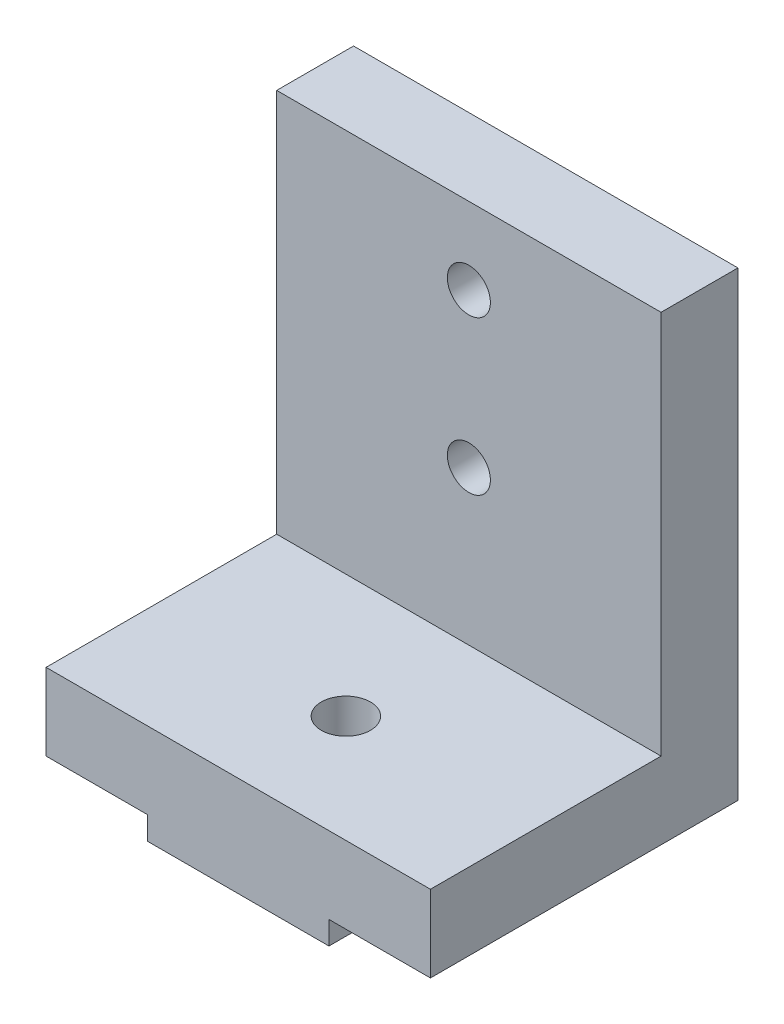
ISO-10303-21;
HEADER;
FILE_DESCRIPTION(('STEP AP214'),'2;1');
FILE_NAME('part.step','',(''),(''),'','','');
FILE_SCHEMA(('AUTOMOTIVE_DESIGN { 1 0 10303 214 1 1 1 1 }'));
ENDSEC;
DATA;
#1=APPLICATION_CONTEXT('core data for automotive mechanical design processes');
#2=APPLICATION_PROTOCOL_DEFINITION('international standard','automotive_design',2000,#1);
#3=PRODUCT_CONTEXT('',#1,'mechanical');
#4=PRODUCT('Part','Part','',(#3));
#5=PRODUCT_RELATED_PRODUCT_CATEGORY('part','',(#4));
#6=PRODUCT_DEFINITION_FORMATION('','',#4);
#7=PRODUCT_DEFINITION_CONTEXT('part definition',#1,'design');
#8=PRODUCT_DEFINITION('design','',#6,#7);
#9=PRODUCT_DEFINITION_SHAPE('','',#8);
#10=(LENGTH_UNIT() NAMED_UNIT(*) SI_UNIT(.MILLI.,.METRE.));
#11=(NAMED_UNIT(*) PLANE_ANGLE_UNIT() SI_UNIT($,.RADIAN.));
#12=(NAMED_UNIT(*) SI_UNIT($,.STERADIAN.) SOLID_ANGLE_UNIT());
#13=UNCERTAINTY_MEASURE_WITH_UNIT(LENGTH_MEASURE(1.E-05),#10,'distance_accuracy_value','');
#14=(GEOMETRIC_REPRESENTATION_CONTEXT(3) GLOBAL_UNCERTAINTY_ASSIGNED_CONTEXT((#13)) GLOBAL_UNIT_ASSIGNED_CONTEXT((#10,
#11,#12)) REPRESENTATION_CONTEXT('',''));
#15=CARTESIAN_POINT('',(0.,0.,0.));
#16=DIRECTION('',(0.,0.,1.));
#17=DIRECTION('',(1.,0.,0.));
#18=AXIS2_PLACEMENT_3D('',#15,#16,#17);
#19=CARTESIAN_POINT('',(0.,6.5,20.));
#20=DIRECTION('',(0.,1.,0.));
#21=DIRECTION('',(0.,0.,1.));
#22=AXIS2_PLACEMENT_3D('',#19,#20,#21);
#23=PLANE('',#22);
#24=CARTESIAN_POINT('',(5.89999999999999,6.5,13.));
#25=DIRECTION('',(0.,1.,0.));
#26=DIRECTION('',(0.,0.,1.));
#27=AXIS2_PLACEMENT_3D('',#24,#25,#26);
#28=CIRCLE('',#27,1.6);
#29=CARTESIAN_POINT('',(5.89999999999999,6.5,14.6));
#30=VERTEX_POINT('',#29);
#31=EDGE_CURVE('E353',#30,#30,#28,.T.);
#32=ORIENTED_EDGE('',*,*,#31,.F.);
#33=EDGE_LOOP('',(#32));
#34=FACE_BOUND('',#33,.T.);
#35=DIRECTION('',(0.,0.,-1.));
#36=VECTOR('',#35,1.);
#37=CARTESIAN_POINT('',(18.4,6.5,20.));
#38=LINE('',#37,#36);
#39=CARTESIAN_POINT('',(18.4,6.5,20.));
#40=VERTEX_POINT('',#39);
#41=CARTESIAN_POINT('',(18.4,6.5,5.));
#42=VERTEX_POINT('',#41);
#43=EDGE_CURVE('E11',#40,#42,#38,.T.);
#44=ORIENTED_EDGE('',*,*,#43,.T.);
#45=DIRECTION('',(-1.,0.,0.));
#46=VECTOR('',#45,1.);
#47=CARTESIAN_POINT('',(18.4,6.5,5.));
#48=LINE('',#47,#46);
#49=CARTESIAN_POINT('',(-6.60000000000001,6.5,5.));
#50=VERTEX_POINT('',#49);
#51=EDGE_CURVE('E192',#42,#50,#48,.T.);
#52=ORIENTED_EDGE('',*,*,#51,.T.);
#53=DIRECTION('',(0.,0.,-1.));
#54=VECTOR('',#53,1.);
#55=CARTESIAN_POINT('',(-6.60000000000001,6.5,20.));
#56=LINE('',#55,#54);
#57=CARTESIAN_POINT('',(-6.60000000000001,6.5,20.));
#58=VERTEX_POINT('',#57);
#59=EDGE_CURVE('E48',#58,#50,#56,.T.);
#60=ORIENTED_EDGE('',*,*,#59,.F.);
#61=DIRECTION('',(1.,0.,0.));
#62=VECTOR('',#61,1.);
#63=CARTESIAN_POINT('',(0.,6.5,20.));
#64=LINE('',#63,#62);
#65=EDGE_CURVE('E191',#58,#40,#64,.T.);
#66=ORIENTED_EDGE('',*,*,#65,.T.);
#67=EDGE_LOOP('',(#44,#52,#60,#66));
#68=FACE_BOUND('',#67,.T.);
#69=ADVANCED_FACE('F39',(#34,#68),#23,.T.);
#70=CARTESIAN_POINT('',(18.4,0.,20.));
#71=DIRECTION('',(1.,0.,0.));
#72=DIRECTION('',(0.,1.,0.));
#73=AXIS2_PLACEMENT_3D('',#70,#71,#72);
#74=PLANE('',#73);
#75=DIRECTION('',(0.,-1.,0.));
#76=VECTOR('',#75,1.);
#77=CARTESIAN_POINT('',(18.4,0.,0.));
#78=LINE('',#77,#76);
#79=CARTESIAN_POINT('',(18.4,31.5,0.));
#80=VERTEX_POINT('',#79);
#81=CARTESIAN_POINT('',(18.4,1.5,0.));
#82=VERTEX_POINT('',#81);
#83=EDGE_CURVE('E145',#80,#82,#78,.T.);
#84=ORIENTED_EDGE('',*,*,#83,.F.);
#85=DIRECTION('',(0.,0.,-1.));
#86=VECTOR('',#85,1.);
#87=CARTESIAN_POINT('',(18.4,31.5,5.));
#88=LINE('',#87,#86);
#89=CARTESIAN_POINT('',(18.4,31.5,5.));
#90=VERTEX_POINT('',#89);
#91=EDGE_CURVE('E150',#90,#80,#88,.T.);
#92=ORIENTED_EDGE('',*,*,#91,.F.);
#93=DIRECTION('',(0.,-1.,0.));
#94=VECTOR('',#93,1.);
#95=CARTESIAN_POINT('',(18.4,6.5,5.));
#96=LINE('',#95,#94);
#97=EDGE_CURVE('E196',#90,#42,#96,.T.);
#98=ORIENTED_EDGE('',*,*,#97,.T.);
#99=ORIENTED_EDGE('',*,*,#43,.F.);
#100=DIRECTION('',(0.,-1.,0.));
#101=VECTOR('',#100,1.);
#102=CARTESIAN_POINT('',(18.4,0.,20.));
#103=LINE('',#102,#101);
#104=CARTESIAN_POINT('',(18.4,1.5,20.));
#105=VERTEX_POINT('',#104);
#106=EDGE_CURVE('E219',#40,#105,#103,.T.);
#107=ORIENTED_EDGE('',*,*,#106,.T.);
#108=DIRECTION('',(0.,0.,-1.));
#109=VECTOR('',#108,1.);
#110=CARTESIAN_POINT('',(18.4,1.5,20.));
#111=LINE('',#110,#109);
#112=EDGE_CURVE('E91',#105,#82,#111,.T.);
#113=ORIENTED_EDGE('',*,*,#112,.T.);
#114=EDGE_LOOP('',(#84,#92,#98,#99,#107,#113));
#115=FACE_BOUND('',#114,.T.);
#116=ADVANCED_FACE('F41',(#115),#74,.T.);
#117=CARTESIAN_POINT('',(-6.60000000000001,0.,20.));
#118=DIRECTION('',(1.,0.,0.));
#119=DIRECTION('',(0.,1.,0.));
#120=AXIS2_PLACEMENT_3D('',#117,#118,#119);
#121=PLANE('',#120);
#122=DIRECTION('',(0.,-1.,0.));
#123=VECTOR('',#122,1.);
#124=CARTESIAN_POINT('',(-6.60000000000001,0.,0.));
#125=LINE('',#124,#123);
#126=CARTESIAN_POINT('',(-6.60000000000001,31.5,0.));
#127=VERTEX_POINT('',#126);
#128=CARTESIAN_POINT('',(-6.60000000000001,1.5,0.));
#129=VERTEX_POINT('',#128);
#130=EDGE_CURVE('E149',#127,#129,#125,.T.);
#131=ORIENTED_EDGE('',*,*,#130,.T.);
#132=DIRECTION('',(0.,0.,-1.));
#133=VECTOR('',#132,1.);
#134=CARTESIAN_POINT('',(-6.60000000000001,1.5,20.));
#135=LINE('',#134,#133);
#136=CARTESIAN_POINT('',(-6.60000000000001,1.5,20.));
#137=VERTEX_POINT('',#136);
#138=EDGE_CURVE('E176',#137,#129,#135,.T.);
#139=ORIENTED_EDGE('',*,*,#138,.F.);
#140=DIRECTION('',(0.,-1.,0.));
#141=VECTOR('',#140,1.);
#142=CARTESIAN_POINT('',(-6.60000000000001,0.,20.));
#143=LINE('',#142,#141);
#144=EDGE_CURVE('E187',#58,#137,#143,.T.);
#145=ORIENTED_EDGE('',*,*,#144,.F.);
#146=ORIENTED_EDGE('',*,*,#59,.T.);
#147=DIRECTION('',(0.,1.,0.));
#148=VECTOR('',#147,1.);
#149=CARTESIAN_POINT('',(-6.60000000000001,6.5,5.));
#150=LINE('',#149,#148);
#151=CARTESIAN_POINT('',(-6.60000000000001,31.5,5.));
#152=VERTEX_POINT('',#151);
#153=EDGE_CURVE('E55',#50,#152,#150,.T.);
#154=ORIENTED_EDGE('',*,*,#153,.T.);
#155=DIRECTION('',(0.,0.,-1.));
#156=VECTOR('',#155,1.);
#157=CARTESIAN_POINT('',(-6.60000000000001,31.5,5.));
#158=LINE('',#157,#156);
#159=EDGE_CURVE('E209',#152,#127,#158,.T.);
#160=ORIENTED_EDGE('',*,*,#159,.T.);
#161=EDGE_LOOP('',(#131,#139,#145,#146,#154,#160));
#162=FACE_BOUND('',#161,.T.);
#163=ADVANCED_FACE('F183',(#162),#121,.F.);
#164=CARTESIAN_POINT('',(0.,1.5,20.));
#165=DIRECTION('',(0.,1.,0.));
#166=DIRECTION('',(-1.,0.,0.));
#167=AXIS2_PLACEMENT_3D('',#164,#165,#166);
#168=PLANE('',#167);
#169=DIRECTION('',(1.,0.,0.));
#170=VECTOR('',#169,1.);
#171=CARTESIAN_POINT('',(0.,1.5,0.));
#172=LINE('',#171,#170);
#173=CARTESIAN_POINT('',(0.,1.5,0.));
#174=VERTEX_POINT('',#173);
#175=EDGE_CURVE('E153',#129,#174,#172,.T.);
#176=ORIENTED_EDGE('',*,*,#175,.T.);
#177=DIRECTION('',(0.,0.,-1.));
#178=VECTOR('',#177,1.);
#179=CARTESIAN_POINT('',(0.,1.5,20.));
#180=LINE('',#179,#178);
#181=CARTESIAN_POINT('',(0.,1.5,20.));
#182=VERTEX_POINT('',#181);
#183=EDGE_CURVE('E173',#182,#174,#180,.T.);
#184=ORIENTED_EDGE('',*,*,#183,.F.);
#185=DIRECTION('',(1.,0.,0.));
#186=VECTOR('',#185,1.);
#187=CARTESIAN_POINT('',(0.,1.5,20.));
#188=LINE('',#187,#186);
#189=EDGE_CURVE('E142',#137,#182,#188,.T.);
#190=ORIENTED_EDGE('',*,*,#189,.F.);
#191=ORIENTED_EDGE('',*,*,#138,.T.);
#192=EDGE_LOOP('',(#176,#184,#190,#191));
#193=FACE_BOUND('',#192,.T.);
#194=ADVANCED_FACE('F241',(#193),#168,.F.);
#195=CARTESIAN_POINT('',(0.,0.,20.));
#196=DIRECTION('',(-1.,0.,0.));
#197=DIRECTION('',(0.,-1.,0.));
#198=AXIS2_PLACEMENT_3D('',#195,#196,#197);
#199=PLANE('',#198);
#200=DIRECTION('',(0.,1.,0.));
#201=VECTOR('',#200,1.);
#202=CARTESIAN_POINT('',(0.,0.,0.));
#203=LINE('',#202,#201);
#204=CARTESIAN_POINT('',(0.,0.,0.));
#205=VERTEX_POINT('',#204);
#206=EDGE_CURVE('E157',#205,#174,#203,.T.);
#207=ORIENTED_EDGE('',*,*,#206,.F.);
#208=DIRECTION('',(0.,0.,-1.));
#209=VECTOR('',#208,1.);
#210=CARTESIAN_POINT('',(0.,0.,20.));
#211=LINE('',#210,#209);
#212=CARTESIAN_POINT('',(0.,0.,20.));
#213=VERTEX_POINT('',#212);
#214=EDGE_CURVE('E133',#213,#205,#211,.T.);
#215=ORIENTED_EDGE('',*,*,#214,.F.);
#216=DIRECTION('',(0.,1.,0.));
#217=VECTOR('',#216,1.);
#218=CARTESIAN_POINT('',(0.,0.,20.));
#219=LINE('',#218,#217);
#220=EDGE_CURVE('E121',#213,#182,#219,.T.);
#221=ORIENTED_EDGE('',*,*,#220,.T.);
#222=ORIENTED_EDGE('',*,*,#183,.T.);
#223=EDGE_LOOP('',(#207,#215,#221,#222));
#224=FACE_BOUND('',#223,.T.);
#225=ADVANCED_FACE('F229',(#224),#199,.T.);
#226=CARTESIAN_POINT('',(0.,0.,20.));
#227=DIRECTION('',(0.,1.,0.));
#228=DIRECTION('',(0.,0.,1.));
#229=AXIS2_PLACEMENT_3D('',#226,#227,#228);
#230=PLANE('',#229);
#231=CARTESIAN_POINT('',(5.89999999999999,0.,13.));
#232=DIRECTION('',(0.,1.,0.));
#233=DIRECTION('',(0.,0.,1.));
#234=AXIS2_PLACEMENT_3D('',#231,#232,#233);
#235=CIRCLE('',#234,1.6);
#236=CARTESIAN_POINT('',(5.89999999999999,0.,14.6));
#237=VERTEX_POINT('',#236);
#238=EDGE_CURVE('E351',#237,#237,#235,.T.);
#239=ORIENTED_EDGE('',*,*,#238,.T.);
#240=EDGE_LOOP('',(#239));
#241=FACE_BOUND('',#240,.T.);
#242=DIRECTION('',(1.,0.,0.));
#243=VECTOR('',#242,1.);
#244=CARTESIAN_POINT('',(0.,0.,0.));
#245=LINE('',#244,#243);
#246=CARTESIAN_POINT('',(11.8,0.,0.));
#247=VERTEX_POINT('',#246);
#248=EDGE_CURVE('E129',#205,#247,#245,.T.);
#249=ORIENTED_EDGE('',*,*,#248,.T.);
#250=DIRECTION('',(0.,0.,-1.));
#251=VECTOR('',#250,1.);
#252=CARTESIAN_POINT('',(11.8,0.,20.));
#253=LINE('',#252,#251);
#254=CARTESIAN_POINT('',(11.8,0.,20.));
#255=VERTEX_POINT('',#254);
#256=EDGE_CURVE('E126',#255,#247,#253,.T.);
#257=ORIENTED_EDGE('',*,*,#256,.F.);
#258=DIRECTION('',(1.,0.,0.));
#259=VECTOR('',#258,1.);
#260=CARTESIAN_POINT('',(0.,0.,20.));
#261=LINE('',#260,#259);
#262=EDGE_CURVE('E114',#213,#255,#261,.T.);
#263=ORIENTED_EDGE('',*,*,#262,.F.);
#264=ORIENTED_EDGE('',*,*,#214,.T.);
#265=EDGE_LOOP('',(#249,#257,#263,#264));
#266=FACE_BOUND('',#265,.T.);
#267=ADVANCED_FACE('F127',(#241,#266),#230,.F.);
#268=CARTESIAN_POINT('',(11.8,0.,20.));
#269=DIRECTION('',(-1.,0.,0.));
#270=DIRECTION('',(0.,-1.,0.));
#271=AXIS2_PLACEMENT_3D('',#268,#269,#270);
#272=PLANE('',#271);
#273=DIRECTION('',(0.,1.,0.));
#274=VECTOR('',#273,1.);
#275=CARTESIAN_POINT('',(11.8,0.,0.));
#276=LINE('',#275,#274);
#277=CARTESIAN_POINT('',(11.8,1.5,0.));
#278=VERTEX_POINT('',#277);
#279=EDGE_CURVE('E164',#247,#278,#276,.T.);
#280=ORIENTED_EDGE('',*,*,#279,.T.);
#281=DIRECTION('',(0.,0.,-1.));
#282=VECTOR('',#281,1.);
#283=CARTESIAN_POINT('',(11.8,1.5,20.));
#284=LINE('',#283,#282);
#285=CARTESIAN_POINT('',(11.8,1.5,20.));
#286=VERTEX_POINT('',#285);
#287=EDGE_CURVE('E134',#286,#278,#284,.T.);
#288=ORIENTED_EDGE('',*,*,#287,.F.);
#289=DIRECTION('',(0.,1.,0.));
#290=VECTOR('',#289,1.);
#291=CARTESIAN_POINT('',(11.8,0.,20.));
#292=LINE('',#291,#290);
#293=EDGE_CURVE('E118',#255,#286,#292,.T.);
#294=ORIENTED_EDGE('',*,*,#293,.F.);
#295=ORIENTED_EDGE('',*,*,#256,.T.);
#296=EDGE_LOOP('',(#280,#288,#294,#295));
#297=FACE_BOUND('',#296,.T.);
#298=ADVANCED_FACE('F136',(#297),#272,.F.);
#299=EDGE_CURVE('E158',#278,#82,#172,.T.);
#300=ORIENTED_EDGE('',*,*,#299,.T.);
#301=ORIENTED_EDGE('',*,*,#112,.F.);
#302=EDGE_CURVE('E64',#286,#105,#188,.T.);
#303=ORIENTED_EDGE('',*,*,#302,.F.);
#304=ORIENTED_EDGE('',*,*,#287,.T.);
#305=EDGE_LOOP('',(#300,#301,#303,#304));
#306=FACE_BOUND('',#305,.T.);
#307=ADVANCED_FACE('F237',(#306),#168,.F.);
#308=CARTESIAN_POINT('',(0.,0.,20.));
#309=DIRECTION('',(0.,0.,1.));
#310=DIRECTION('',(1.,0.,0.));
#311=AXIS2_PLACEMENT_3D('',#308,#309,#310);
#312=PLANE('',#311);
#313=ORIENTED_EDGE('',*,*,#106,.F.);
#314=ORIENTED_EDGE('',*,*,#65,.F.);
#315=ORIENTED_EDGE('',*,*,#144,.T.);
#316=ORIENTED_EDGE('',*,*,#189,.T.);
#317=ORIENTED_EDGE('',*,*,#220,.F.);
#318=ORIENTED_EDGE('',*,*,#262,.T.);
#319=ORIENTED_EDGE('',*,*,#293,.T.);
#320=ORIENTED_EDGE('',*,*,#302,.T.);
#321=EDGE_LOOP('',(#313,#314,#315,#316,#317,#318,#319,#320));
#322=FACE_BOUND('',#321,.T.);
#323=ADVANCED_FACE('F116',(#322),#312,.T.);
#324=CARTESIAN_POINT('',(0.,0.,0.));
#325=DIRECTION('',(0.,0.,1.));
#326=DIRECTION('',(1.,0.,0.));
#327=AXIS2_PLACEMENT_3D('',#324,#325,#326);
#328=PLANE('',#327);
#329=ORIENTED_EDGE('',*,*,#83,.T.);
#330=ORIENTED_EDGE('',*,*,#299,.F.);
#331=ORIENTED_EDGE('',*,*,#279,.F.);
#332=ORIENTED_EDGE('',*,*,#248,.F.);
#333=ORIENTED_EDGE('',*,*,#206,.T.);
#334=ORIENTED_EDGE('',*,*,#175,.F.);
#335=ORIENTED_EDGE('',*,*,#130,.F.);
#336=DIRECTION('',(1.,0.,0.));
#337=VECTOR('',#336,1.);
#338=CARTESIAN_POINT('',(18.4,31.5,0.));
#339=LINE('',#338,#337);
#340=EDGE_CURVE('E202',#127,#80,#339,.T.);
#341=ORIENTED_EDGE('',*,*,#340,.T.);
#342=EDGE_LOOP('',(#329,#330,#331,#332,#333,#334,#335,#341));
#343=FACE_BOUND('',#342,.T.);
#344=CARTESIAN_POINT('',(5.89999999999999,26.5,0.));
#345=DIRECTION('',(0.,0.,-1.));
#346=DIRECTION('',(-1.,0.,0.));
#347=AXIS2_PLACEMENT_3D('',#344,#345,#346);
#348=CIRCLE('',#347,1.4);
#349=CARTESIAN_POINT('',(4.49999999999999,26.5,0.));
#350=VERTEX_POINT('',#349);
#351=EDGE_CURVE('E357',#350,#350,#348,.T.);
#352=ORIENTED_EDGE('',*,*,#351,.F.);
#353=EDGE_LOOP('',(#352));
#354=FACE_BOUND('',#353,.T.);
#355=CARTESIAN_POINT('',(5.89999999999999,16.5,0.));
#356=DIRECTION('',(0.,0.,-1.));
#357=DIRECTION('',(-1.,0.,0.));
#358=AXIS2_PLACEMENT_3D('',#355,#356,#357);
#359=CIRCLE('',#358,1.4);
#360=CARTESIAN_POINT('',(4.49999999999999,16.5,0.));
#361=VERTEX_POINT('',#360);
#362=EDGE_CURVE('E363',#361,#361,#359,.T.);
#363=ORIENTED_EDGE('',*,*,#362,.F.);
#364=EDGE_LOOP('',(#363));
#365=FACE_BOUND('',#364,.T.);
#366=ADVANCED_FACE('F232',(#343,#354,#365),#328,.F.);
#367=CARTESIAN_POINT('',(18.4,31.5,5.));
#368=DIRECTION('',(0.,1.,0.));
#369=DIRECTION('',(0.,0.,1.));
#370=AXIS2_PLACEMENT_3D('',#367,#368,#369);
#371=PLANE('',#370);
#372=ORIENTED_EDGE('',*,*,#340,.F.);
#373=ORIENTED_EDGE('',*,*,#159,.F.);
#374=DIRECTION('',(1.,0.,0.));
#375=VECTOR('',#374,1.);
#376=CARTESIAN_POINT('',(18.4,31.5,5.));
#377=LINE('',#376,#375);
#378=EDGE_CURVE('E200',#152,#90,#377,.T.);
#379=ORIENTED_EDGE('',*,*,#378,.T.);
#380=ORIENTED_EDGE('',*,*,#91,.T.);
#381=EDGE_LOOP('',(#372,#373,#379,#380));
#382=FACE_BOUND('',#381,.T.);
#383=ADVANCED_FACE('F246',(#382),#371,.T.);
#384=CARTESIAN_POINT('',(0.,0.,5.));
#385=DIRECTION('',(0.,0.,1.));
#386=DIRECTION('',(1.,0.,0.));
#387=AXIS2_PLACEMENT_3D('',#384,#385,#386);
#388=PLANE('',#387);
#389=CARTESIAN_POINT('',(5.89999999999999,26.5,5.));
#390=DIRECTION('',(0.,0.,-1.));
#391=DIRECTION('',(-1.,0.,0.));
#392=AXIS2_PLACEMENT_3D('',#389,#390,#391);
#393=CIRCLE('',#392,1.4);
#394=CARTESIAN_POINT('',(4.49999999999999,26.5,5.));
#395=VERTEX_POINT('',#394);
#396=EDGE_CURVE('E360',#395,#395,#393,.T.);
#397=ORIENTED_EDGE('',*,*,#396,.T.);
#398=EDGE_LOOP('',(#397));
#399=FACE_BOUND('',#398,.T.);
#400=CARTESIAN_POINT('',(5.89999999999999,16.5,5.));
#401=DIRECTION('',(0.,0.,-1.));
#402=DIRECTION('',(-1.,0.,0.));
#403=AXIS2_PLACEMENT_3D('',#400,#401,#402);
#404=CIRCLE('',#403,1.4);
#405=CARTESIAN_POINT('',(4.49999999999999,16.5,5.));
#406=VERTEX_POINT('',#405);
#407=EDGE_CURVE('E213',#406,#406,#404,.T.);
#408=ORIENTED_EDGE('',*,*,#407,.T.);
#409=EDGE_LOOP('',(#408));
#410=FACE_BOUND('',#409,.T.);
#411=ORIENTED_EDGE('',*,*,#97,.F.);
#412=ORIENTED_EDGE('',*,*,#378,.F.);
#413=ORIENTED_EDGE('',*,*,#153,.F.);
#414=ORIENTED_EDGE('',*,*,#51,.F.);
#415=EDGE_LOOP('',(#411,#412,#413,#414));
#416=FACE_BOUND('',#415,.T.);
#417=ADVANCED_FACE('F249',(#399,#410,#416),#388,.T.);
#418=CARTESIAN_POINT('',(5.89999999999999,16.5,5.));
#419=DIRECTION('',(0.,0.,-1.));
#420=DIRECTION('',(-1.,0.,0.));
#421=AXIS2_PLACEMENT_3D('',#418,#419,#420);
#422=CYLINDRICAL_SURFACE('',#421,1.4);
#423=ORIENTED_EDGE('',*,*,#407,.F.);
#424=EDGE_LOOP('',(#423));
#425=FACE_BOUND('',#424,.T.);
#426=ORIENTED_EDGE('',*,*,#362,.T.);
#427=EDGE_LOOP('',(#426));
#428=FACE_BOUND('',#427,.T.);
#429=ADVANCED_FACE('F253',(#425,#428),#422,.F.);
#430=CARTESIAN_POINT('',(5.89999999999999,26.5,5.));
#431=DIRECTION('',(0.,0.,-1.));
#432=DIRECTION('',(-1.,0.,0.));
#433=AXIS2_PLACEMENT_3D('',#430,#431,#432);
#434=CYLINDRICAL_SURFACE('',#433,1.4);
#435=ORIENTED_EDGE('',*,*,#396,.F.);
#436=EDGE_LOOP('',(#435));
#437=FACE_BOUND('',#436,.T.);
#438=ORIENTED_EDGE('',*,*,#351,.T.);
#439=EDGE_LOOP('',(#438));
#440=FACE_BOUND('',#439,.T.);
#441=ADVANCED_FACE('F260',(#437,#440),#434,.F.);
#442=CARTESIAN_POINT('',(5.89999999999999,0.,13.));
#443=DIRECTION('',(0.,1.,0.));
#444=DIRECTION('',(0.,0.,1.));
#445=AXIS2_PLACEMENT_3D('',#442,#443,#444);
#446=CYLINDRICAL_SURFACE('',#445,1.6);
#447=ORIENTED_EDGE('',*,*,#238,.F.);
#448=EDGE_LOOP('',(#447));
#449=FACE_BOUND('',#448,.T.);
#450=ORIENTED_EDGE('',*,*,#31,.T.);
#451=EDGE_LOOP('',(#450));
#452=FACE_BOUND('',#451,.T.);
#453=ADVANCED_FACE('F319',(#449,#452),#446,.F.);
#454=CLOSED_SHELL('',(#69,#116,#163,#194,#225,#267,#298,#307,#323,#366,#383,#417,#429,#441,#453));
#455=MANIFOLD_SOLID_BREP('B2',#454);
#456=ADVANCED_BREP_SHAPE_REPRESENTATION('',(#18,#455),#14);
#457=SHAPE_DEFINITION_REPRESENTATION(#9,#456);
ENDSEC;
END-ISO-10303-21;
